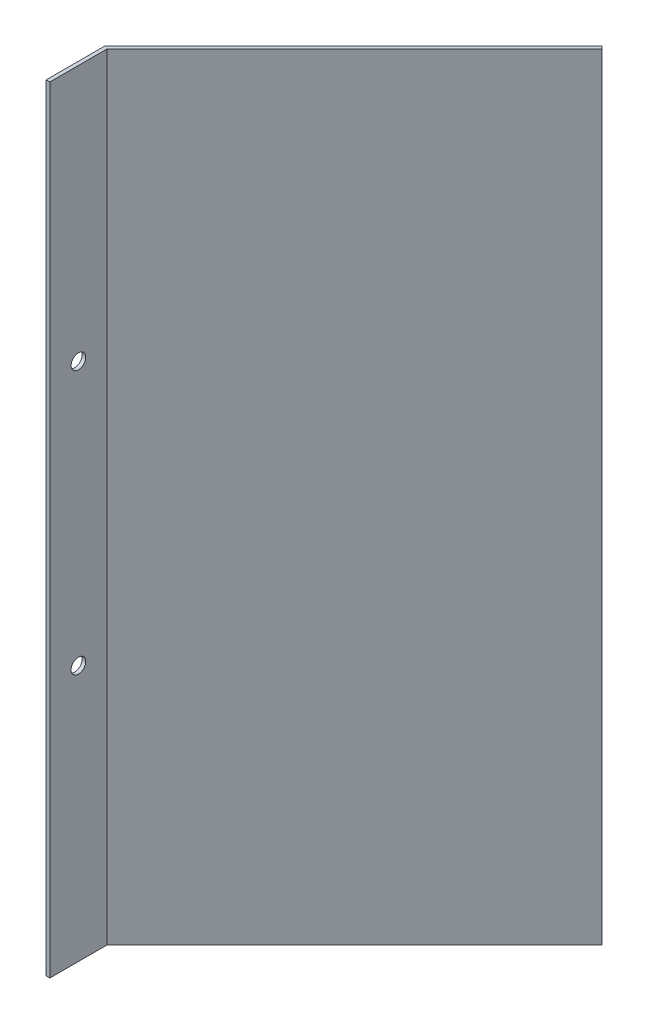
ISO-10303-21;
HEADER;
FILE_DESCRIPTION(('STEP AP214'),'2;1');
FILE_NAME('part.step','',(''),(''),'','','');
FILE_SCHEMA(('AUTOMOTIVE_DESIGN { 1 0 10303 214 1 1 1 1 }'));
ENDSEC;
DATA;
#1=APPLICATION_CONTEXT('core data for automotive mechanical design processes');
#2=APPLICATION_PROTOCOL_DEFINITION('international standard','automotive_design',2000,#1);
#3=PRODUCT_CONTEXT('',#1,'mechanical');
#4=PRODUCT('Part','Part','',(#3));
#5=PRODUCT_RELATED_PRODUCT_CATEGORY('part','',(#4));
#6=PRODUCT_DEFINITION_FORMATION('','',#4);
#7=PRODUCT_DEFINITION_CONTEXT('part definition',#1,'design');
#8=PRODUCT_DEFINITION('design','',#6,#7);
#9=PRODUCT_DEFINITION_SHAPE('','',#8);
#10=(LENGTH_UNIT() NAMED_UNIT(*) SI_UNIT(.MILLI.,.METRE.));
#11=(NAMED_UNIT(*) PLANE_ANGLE_UNIT() SI_UNIT($,.RADIAN.));
#12=(NAMED_UNIT(*) SI_UNIT($,.STERADIAN.) SOLID_ANGLE_UNIT());
#13=UNCERTAINTY_MEASURE_WITH_UNIT(LENGTH_MEASURE(1.E-05),#10,'distance_accuracy_value','');
#14=(GEOMETRIC_REPRESENTATION_CONTEXT(3) GLOBAL_UNCERTAINTY_ASSIGNED_CONTEXT((#13)) GLOBAL_UNIT_ASSIGNED_CONTEXT((#10,
#11,#12)) REPRESENTATION_CONTEXT('',''));
#15=CARTESIAN_POINT('',(0.,0.,0.));
#16=DIRECTION('',(0.,0.,1.));
#17=DIRECTION('',(1.,0.,0.));
#18=AXIS2_PLACEMENT_3D('',#15,#16,#17);
#19=CARTESIAN_POINT('',(3.175,673.1,0.));
#20=DIRECTION('',(0.,0.,-1.));
#21=DIRECTION('',(-1.,0.,0.));
#22=AXIS2_PLACEMENT_3D('',#19,#20,#21);
#23=PLANE('',#22);
#24=DIRECTION('',(1.,0.,0.));
#25=VECTOR('',#24,1.);
#26=CARTESIAN_POINT('',(3.175,0.,0.));
#27=LINE('',#26,#25);
#28=CARTESIAN_POINT('',(0.,0.,0.));
#29=VERTEX_POINT('',#28);
#30=CARTESIAN_POINT('',(3.175,0.,0.));
#31=VERTEX_POINT('',#30);
#32=EDGE_CURVE('E117',#29,#31,#27,.T.);
#33=ORIENTED_EDGE('',*,*,#32,.T.);
#34=DIRECTION('',(0.,-1.,0.));
#35=VECTOR('',#34,1.);
#36=CARTESIAN_POINT('',(3.175,673.1,0.));
#37=LINE('',#36,#35);
#38=CARTESIAN_POINT('',(3.175,673.1,0.));
#39=VERTEX_POINT('',#38);
#40=EDGE_CURVE('E11',#39,#31,#37,.T.);
#41=ORIENTED_EDGE('',*,*,#40,.F.);
#42=DIRECTION('',(1.,0.,0.));
#43=VECTOR('',#42,1.);
#44=CARTESIAN_POINT('',(3.175,673.1,0.));
#45=LINE('',#44,#43);
#46=CARTESIAN_POINT('',(0.,673.1,0.));
#47=VERTEX_POINT('',#46);
#48=EDGE_CURVE('E128',#47,#39,#45,.T.);
#49=ORIENTED_EDGE('',*,*,#48,.F.);
#50=DIRECTION('',(0.,-1.,0.));
#51=VECTOR('',#50,1.);
#52=CARTESIAN_POINT('',(0.,673.1,0.));
#53=LINE('',#52,#51);
#54=EDGE_CURVE('E113',#47,#29,#53,.T.);
#55=ORIENTED_EDGE('',*,*,#54,.T.);
#56=EDGE_LOOP('',(#33,#41,#49,#55));
#57=FACE_BOUND('',#56,.T.);
#58=ADVANCED_FACE('F33',(#57),#23,.F.);
#59=CARTESIAN_POINT('',(3.17499999999998,673.1,-49.4848719394656));
#60=DIRECTION('',(-1.,0.,0.));
#61=DIRECTION('',(0.,0.,1.));
#62=AXIS2_PLACEMENT_3D('',#59,#60,#61);
#63=PLANE('',#62);
#64=CARTESIAN_POINT('',(3.17499999999999,222.25,-24.7424359697328));
#65=DIRECTION('',(1.,0.,0.));
#66=DIRECTION('',(0.,0.,-1.));
#67=AXIS2_PLACEMENT_3D('',#64,#65,#66);
#68=CIRCLE('',#67,6.35);
#69=CARTESIAN_POINT('',(3.17499999999999,222.25,-31.0924359697328));
#70=VERTEX_POINT('',#69);
#71=EDGE_CURVE('E227',#70,#70,#68,.T.);
#72=ORIENTED_EDGE('',*,*,#71,.F.);
#73=EDGE_LOOP('',(#72));
#74=FACE_BOUND('',#73,.T.);
#75=CARTESIAN_POINT('',(3.17499999999999,450.85,-24.7424359697328));
#76=DIRECTION('',(1.,0.,0.));
#77=DIRECTION('',(0.,0.,-1.));
#78=AXIS2_PLACEMENT_3D('',#75,#76,#77);
#79=CIRCLE('',#78,6.35);
#80=CARTESIAN_POINT('',(3.17499999999999,450.85,-31.0924359697328));
#81=VERTEX_POINT('',#80);
#82=EDGE_CURVE('E229',#81,#81,#79,.T.);
#83=ORIENTED_EDGE('',*,*,#82,.F.);
#84=EDGE_LOOP('',(#83));
#85=FACE_BOUND('',#84,.T.);
#86=DIRECTION('',(0.,0.,-1.));
#87=VECTOR('',#86,1.);
#88=CARTESIAN_POINT('',(3.17499999999998,0.,-49.4848719394656));
#89=LINE('',#88,#87);
#90=CARTESIAN_POINT('',(3.17499999999998,0.,-49.4848719394656));
#91=VERTEX_POINT('',#90);
#92=EDGE_CURVE('E120',#31,#91,#89,.T.);
#93=ORIENTED_EDGE('',*,*,#92,.T.);
#94=DIRECTION('',(0.,-1.,0.));
#95=VECTOR('',#94,1.);
#96=CARTESIAN_POINT('',(3.17499999999998,673.1,-49.4848719394656));
#97=LINE('',#96,#95);
#98=CARTESIAN_POINT('',(3.17499999999998,673.1,-49.4848719394656));
#99=VERTEX_POINT('',#98);
#100=EDGE_CURVE('E41',#99,#91,#97,.T.);
#101=ORIENTED_EDGE('',*,*,#100,.F.);
#102=DIRECTION('',(0.,0.,-1.));
#103=VECTOR('',#102,1.);
#104=CARTESIAN_POINT('',(3.17499999999998,673.1,-49.4848719394656));
#105=LINE('',#104,#103);
#106=EDGE_CURVE('E86',#39,#99,#105,.T.);
#107=ORIENTED_EDGE('',*,*,#106,.F.);
#108=ORIENTED_EDGE('',*,*,#40,.T.);
#109=EDGE_LOOP('',(#93,#101,#107,#108));
#110=FACE_BOUND('',#109,.T.);
#111=ADVANCED_FACE('F155',(#74,#85,#110),#63,.F.);
#112=CARTESIAN_POINT('',(217.771210935927,673.1,-264.081082875392));
#113=DIRECTION('',(-0.707106781186546,0.,-0.707106781186549));
#114=DIRECTION('',(-0.707106781186549,0.,0.707106781186546));
#115=AXIS2_PLACEMENT_3D('',#112,#113,#114);
#116=PLANE('',#115);
#117=DIRECTION('',(0.707106781186549,0.,-0.707106781186546));
#118=VECTOR('',#117,1.);
#119=CARTESIAN_POINT('',(217.771210935927,0.,-264.081082875392));
#120=LINE('',#119,#118);
#121=CARTESIAN_POINT('',(217.771210935927,0.,-264.081082875392));
#122=VERTEX_POINT('',#121);
#123=EDGE_CURVE('E123',#91,#122,#120,.T.);
#124=ORIENTED_EDGE('',*,*,#123,.T.);
#125=DIRECTION('',(0.,-1.,0.));
#126=VECTOR('',#125,1.);
#127=CARTESIAN_POINT('',(217.771210935927,673.1,-264.081082875392));
#128=LINE('',#127,#126);
#129=CARTESIAN_POINT('',(217.771210935927,673.1,-264.081082875392));
#130=VERTEX_POINT('',#129);
#131=EDGE_CURVE('E108',#130,#122,#128,.T.);
#132=ORIENTED_EDGE('',*,*,#131,.F.);
#133=DIRECTION('',(0.707106781186549,0.,-0.707106781186546));
#134=VECTOR('',#133,1.);
#135=CARTESIAN_POINT('',(217.771210935927,673.1,-264.081082875392));
#136=LINE('',#135,#134);
#137=EDGE_CURVE('E99',#99,#130,#136,.T.);
#138=ORIENTED_EDGE('',*,*,#137,.F.);
#139=ORIENTED_EDGE('',*,*,#100,.T.);
#140=EDGE_LOOP('',(#124,#132,#138,#139));
#141=FACE_BOUND('',#140,.T.);
#142=ADVANCED_FACE('F134',(#141),#116,.F.);
#143=CARTESIAN_POINT('',(215.52614690566,673.1,-266.326146905659));
#144=DIRECTION('',(-0.707106781186556,0.,0.707106781186539));
#145=DIRECTION('',(0.707106781186539,0.,0.707106781186556));
#146=AXIS2_PLACEMENT_3D('',#143,#144,#145);
#147=PLANE('',#146);
#148=DIRECTION('',(-0.707106781186539,0.,-0.707106781186556));
#149=VECTOR('',#148,1.);
#150=CARTESIAN_POINT('',(215.52614690566,0.,-266.326146905659));
#151=LINE('',#150,#149);
#152=CARTESIAN_POINT('',(215.52614690566,0.,-266.326146905659));
#153=VERTEX_POINT('',#152);
#154=EDGE_CURVE('E107',#122,#153,#151,.T.);
#155=ORIENTED_EDGE('',*,*,#154,.T.);
#156=DIRECTION('',(0.,-1.,0.));
#157=VECTOR('',#156,1.);
#158=CARTESIAN_POINT('',(215.52614690566,673.1,-266.326146905659));
#159=LINE('',#158,#157);
#160=CARTESIAN_POINT('',(215.52614690566,673.1,-266.326146905659));
#161=VERTEX_POINT('',#160);
#162=EDGE_CURVE('E104',#161,#153,#159,.T.);
#163=ORIENTED_EDGE('',*,*,#162,.F.);
#164=DIRECTION('',(-0.707106781186539,0.,-0.707106781186556));
#165=VECTOR('',#164,1.);
#166=CARTESIAN_POINT('',(215.52614690566,673.1,-266.326146905659));
#167=LINE('',#166,#165);
#168=EDGE_CURVE('E93',#130,#161,#167,.T.);
#169=ORIENTED_EDGE('',*,*,#168,.F.);
#170=ORIENTED_EDGE('',*,*,#131,.T.);
#171=EDGE_LOOP('',(#155,#163,#169,#170));
#172=FACE_BOUND('',#171,.T.);
#173=ADVANCED_FACE('F105',(#172),#147,.F.);
#174=CARTESIAN_POINT('',(0.,673.1,-50.8));
#175=DIRECTION('',(0.707106781186547,0.,0.707106781186548));
#176=DIRECTION('',(0.707106781186548,0.,-0.707106781186547));
#177=AXIS2_PLACEMENT_3D('',#174,#175,#176);
#178=PLANE('',#177);
#179=DIRECTION('',(-0.707106781186548,0.,0.707106781186547));
#180=VECTOR('',#179,1.);
#181=CARTESIAN_POINT('',(0.,0.,-50.8));
#182=LINE('',#181,#180);
#183=CARTESIAN_POINT('',(0.,0.,-50.8));
#184=VERTEX_POINT('',#183);
#185=EDGE_CURVE('E72',#153,#184,#182,.T.);
#186=ORIENTED_EDGE('',*,*,#185,.T.);
#187=DIRECTION('',(0.,-1.,0.));
#188=VECTOR('',#187,1.);
#189=CARTESIAN_POINT('',(0.,673.1,-50.8));
#190=LINE('',#189,#188);
#191=CARTESIAN_POINT('',(0.,673.1,-50.8));
#192=VERTEX_POINT('',#191);
#193=EDGE_CURVE('E109',#192,#184,#190,.T.);
#194=ORIENTED_EDGE('',*,*,#193,.F.);
#195=DIRECTION('',(-0.707106781186548,0.,0.707106781186547));
#196=VECTOR('',#195,1.);
#197=CARTESIAN_POINT('',(0.,673.1,-50.8));
#198=LINE('',#197,#196);
#199=EDGE_CURVE('E97',#161,#192,#198,.T.);
#200=ORIENTED_EDGE('',*,*,#199,.F.);
#201=ORIENTED_EDGE('',*,*,#162,.T.);
#202=EDGE_LOOP('',(#186,#194,#200,#201));
#203=FACE_BOUND('',#202,.T.);
#204=ADVANCED_FACE('F111',(#203),#178,.F.);
#205=CARTESIAN_POINT('',(0.,673.1,0.));
#206=DIRECTION('',(1.,0.,0.));
#207=DIRECTION('',(0.,0.,-1.));
#208=AXIS2_PLACEMENT_3D('',#205,#206,#207);
#209=PLANE('',#208);
#210=CARTESIAN_POINT('',(0.,222.25,-24.7424359697328));
#211=DIRECTION('',(1.,0.,0.));
#212=DIRECTION('',(0.,0.,-1.));
#213=AXIS2_PLACEMENT_3D('',#210,#211,#212);
#214=CIRCLE('',#213,6.35);
#215=CARTESIAN_POINT('',(0.,222.25,-31.0924359697328));
#216=VERTEX_POINT('',#215);
#217=EDGE_CURVE('E225',#216,#216,#214,.T.);
#218=ORIENTED_EDGE('',*,*,#217,.T.);
#219=EDGE_LOOP('',(#218));
#220=FACE_BOUND('',#219,.T.);
#221=CARTESIAN_POINT('',(0.,450.85,-24.7424359697328));
#222=DIRECTION('',(1.,0.,0.));
#223=DIRECTION('',(0.,0.,-1.));
#224=AXIS2_PLACEMENT_3D('',#221,#222,#223);
#225=CIRCLE('',#224,6.35);
#226=CARTESIAN_POINT('',(0.,450.85,-31.0924359697328));
#227=VERTEX_POINT('',#226);
#228=EDGE_CURVE('E121',#227,#227,#225,.T.);
#229=ORIENTED_EDGE('',*,*,#228,.T.);
#230=EDGE_LOOP('',(#229));
#231=FACE_BOUND('',#230,.T.);
#232=DIRECTION('',(0.,0.,1.));
#233=VECTOR('',#232,1.);
#234=CARTESIAN_POINT('',(0.,0.,0.));
#235=LINE('',#234,#233);
#236=EDGE_CURVE('E78',#184,#29,#235,.T.);
#237=ORIENTED_EDGE('',*,*,#236,.T.);
#238=ORIENTED_EDGE('',*,*,#54,.F.);
#239=DIRECTION('',(0.,0.,1.));
#240=VECTOR('',#239,1.);
#241=CARTESIAN_POINT('',(0.,673.1,0.));
#242=LINE('',#241,#240);
#243=EDGE_CURVE('E49',#192,#47,#242,.T.);
#244=ORIENTED_EDGE('',*,*,#243,.F.);
#245=ORIENTED_EDGE('',*,*,#193,.T.);
#246=EDGE_LOOP('',(#237,#238,#244,#245));
#247=FACE_BOUND('',#246,.T.);
#248=ADVANCED_FACE('F141',(#220,#231,#247),#209,.F.);
#249=CARTESIAN_POINT('',(0.,673.1,0.));
#250=DIRECTION('',(0.,-1.,0.));
#251=DIRECTION('',(0.,0.,-1.));
#252=AXIS2_PLACEMENT_3D('',#249,#250,#251);
#253=PLANE('',#252);
#254=ORIENTED_EDGE('',*,*,#48,.T.);
#255=ORIENTED_EDGE('',*,*,#106,.T.);
#256=ORIENTED_EDGE('',*,*,#137,.T.);
#257=ORIENTED_EDGE('',*,*,#168,.T.);
#258=ORIENTED_EDGE('',*,*,#199,.T.);
#259=ORIENTED_EDGE('',*,*,#243,.T.);
#260=EDGE_LOOP('',(#254,#255,#256,#257,#258,#259));
#261=FACE_BOUND('',#260,.T.);
#262=ADVANCED_FACE('F95',(#261),#253,.F.);
#263=CARTESIAN_POINT('',(0.,0.,0.));
#264=DIRECTION('',(0.,-1.,0.));
#265=DIRECTION('',(0.,0.,-1.));
#266=AXIS2_PLACEMENT_3D('',#263,#264,#265);
#267=PLANE('',#266);
#268=ORIENTED_EDGE('',*,*,#32,.F.);
#269=ORIENTED_EDGE('',*,*,#236,.F.);
#270=ORIENTED_EDGE('',*,*,#185,.F.);
#271=ORIENTED_EDGE('',*,*,#154,.F.);
#272=ORIENTED_EDGE('',*,*,#123,.F.);
#273=ORIENTED_EDGE('',*,*,#92,.F.);
#274=EDGE_LOOP('',(#268,#269,#270,#271,#272,#273));
#275=FACE_BOUND('',#274,.T.);
#276=ADVANCED_FACE('F137',(#275),#267,.T.);
#277=CARTESIAN_POINT('',(0.,450.85,-24.7424359697328));
#278=DIRECTION('',(1.,0.,0.));
#279=DIRECTION('',(0.,0.,-1.));
#280=AXIS2_PLACEMENT_3D('',#277,#278,#279);
#281=CYLINDRICAL_SURFACE('',#280,6.35);
#282=ORIENTED_EDGE('',*,*,#228,.F.);
#283=EDGE_LOOP('',(#282));
#284=FACE_BOUND('',#283,.T.);
#285=ORIENTED_EDGE('',*,*,#82,.T.);
#286=EDGE_LOOP('',(#285));
#287=FACE_BOUND('',#286,.T.);
#288=ADVANCED_FACE('F191',(#284,#287),#281,.F.);
#289=CARTESIAN_POINT('',(0.,222.25,-24.7424359697328));
#290=DIRECTION('',(1.,0.,0.));
#291=DIRECTION('',(0.,0.,-1.));
#292=AXIS2_PLACEMENT_3D('',#289,#290,#291);
#293=CYLINDRICAL_SURFACE('',#292,6.35);
#294=ORIENTED_EDGE('',*,*,#217,.F.);
#295=EDGE_LOOP('',(#294));
#296=FACE_BOUND('',#295,.T.);
#297=ORIENTED_EDGE('',*,*,#71,.T.);
#298=EDGE_LOOP('',(#297));
#299=FACE_BOUND('',#298,.T.);
#300=ADVANCED_FACE('F209',(#296,#299),#293,.F.);
#301=CLOSED_SHELL('',(#58,#111,#142,#173,#204,#248,#262,#276,#288,#300));
#302=MANIFOLD_SOLID_BREP('B2',#301);
#303=ADVANCED_BREP_SHAPE_REPRESENTATION('',(#18,#302),#14);
#304=SHAPE_DEFINITION_REPRESENTATION(#9,#303);
ENDSEC;
END-ISO-10303-21;
